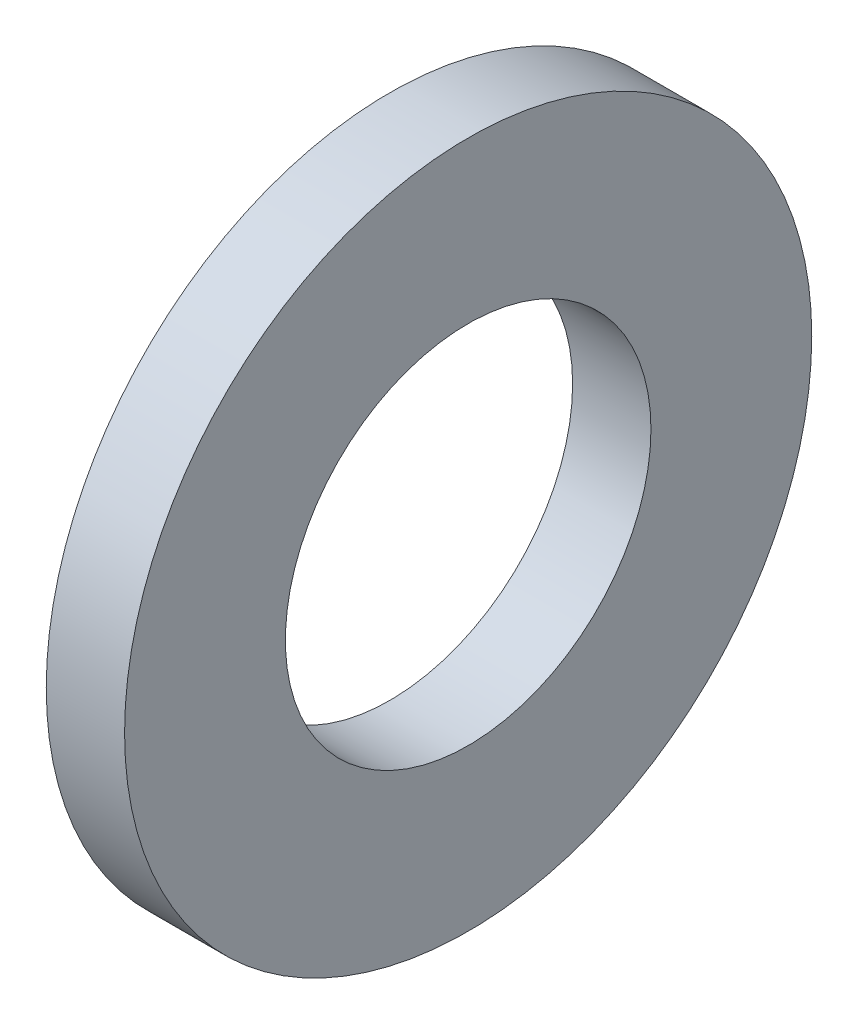
ISO-10303-21;
HEADER;
FILE_DESCRIPTION(('STEP AP214'),'2;1');
FILE_NAME('part.step','',(''),(''),'','','');
FILE_SCHEMA(('AUTOMOTIVE_DESIGN { 1 0 10303 214 1 1 1 1 }'));
ENDSEC;
DATA;
#1=APPLICATION_CONTEXT('core data for automotive mechanical design processes');
#2=APPLICATION_PROTOCOL_DEFINITION('international standard','automotive_design',2000,#1);
#3=PRODUCT_CONTEXT('',#1,'mechanical');
#4=PRODUCT('Part','Part','',(#3));
#5=PRODUCT_RELATED_PRODUCT_CATEGORY('part','',(#4));
#6=PRODUCT_DEFINITION_FORMATION('','',#4);
#7=PRODUCT_DEFINITION_CONTEXT('part definition',#1,'design');
#8=PRODUCT_DEFINITION('design','',#6,#7);
#9=PRODUCT_DEFINITION_SHAPE('','',#8);
#10=(LENGTH_UNIT() NAMED_UNIT(*) SI_UNIT(.MILLI.,.METRE.));
#11=(NAMED_UNIT(*) PLANE_ANGLE_UNIT() SI_UNIT($,.RADIAN.));
#12=(NAMED_UNIT(*) SI_UNIT($,.STERADIAN.) SOLID_ANGLE_UNIT());
#13=UNCERTAINTY_MEASURE_WITH_UNIT(LENGTH_MEASURE(1.E-05),#10,'distance_accuracy_value','');
#14=(GEOMETRIC_REPRESENTATION_CONTEXT(3) GLOBAL_UNCERTAINTY_ASSIGNED_CONTEXT((#13)) GLOBAL_UNIT_ASSIGNED_CONTEXT((#10,
#11,#12)) REPRESENTATION_CONTEXT('',''));
#15=CARTESIAN_POINT('',(0.,0.,0.));
#16=DIRECTION('',(0.,0.,1.));
#17=DIRECTION('',(1.,0.,0.));
#18=AXIS2_PLACEMENT_3D('',#15,#16,#17);
#19=CARTESIAN_POINT('',(1.4478,0.,0.));
#20=DIRECTION('',(1.,0.,0.));
#21=DIRECTION('',(0.,0.,-1.));
#22=AXIS2_PLACEMENT_3D('',#19,#20,#21);
#23=PLANE('',#22);
#24=CARTESIAN_POINT('',(1.4478,0.,0.));
#25=DIRECTION('',(1.,0.,0.));
#26=DIRECTION('',(0.,0.,-1.));
#27=AXIS2_PLACEMENT_3D('',#24,#25,#26);
#28=CIRCLE('',#27,6.35);
#29=CARTESIAN_POINT('',(1.4478,0.,-6.35));
#30=VERTEX_POINT('',#29);
#31=EDGE_CURVE('E10',#30,#30,#28,.T.);
#32=ORIENTED_EDGE('',*,*,#31,.T.);
#33=EDGE_LOOP('',(#32));
#34=FACE_BOUND('',#33,.T.);
#35=CARTESIAN_POINT('',(1.4478,0.,0.));
#36=DIRECTION('',(1.,0.,0.));
#37=DIRECTION('',(0.,0.,-1.));
#38=AXIS2_PLACEMENT_3D('',#35,#36,#37);
#39=CIRCLE('',#38,3.3782);
#40=CARTESIAN_POINT('',(1.4478,0.,-3.3782));
#41=VERTEX_POINT('',#40);
#42=EDGE_CURVE('E41',#41,#41,#39,.T.);
#43=ORIENTED_EDGE('',*,*,#42,.F.);
#44=EDGE_LOOP('',(#43));
#45=FACE_BOUND('',#44,.T.);
#46=ADVANCED_FACE('F30',(#34,#45),#23,.T.);
#47=CARTESIAN_POINT('',(0.,0.,0.));
#48=DIRECTION('',(1.,0.,0.));
#49=DIRECTION('',(0.,0.,-1.));
#50=AXIS2_PLACEMENT_3D('',#47,#48,#49);
#51=PLANE('',#50);
#52=CARTESIAN_POINT('',(0.,0.,0.));
#53=DIRECTION('',(1.,0.,0.));
#54=DIRECTION('',(0.,0.,-1.));
#55=AXIS2_PLACEMENT_3D('',#52,#53,#54);
#56=CIRCLE('',#55,6.35);
#57=CARTESIAN_POINT('',(0.,0.,-6.35));
#58=VERTEX_POINT('',#57);
#59=EDGE_CURVE('E34',#58,#58,#56,.T.);
#60=ORIENTED_EDGE('',*,*,#59,.F.);
#61=EDGE_LOOP('',(#60));
#62=FACE_BOUND('',#61,.T.);
#63=CARTESIAN_POINT('',(0.,0.,0.));
#64=DIRECTION('',(1.,0.,0.));
#65=DIRECTION('',(0.,0.,-1.));
#66=AXIS2_PLACEMENT_3D('',#63,#64,#65);
#67=CIRCLE('',#66,3.3782);
#68=CARTESIAN_POINT('',(0.,0.,-3.3782));
#69=VERTEX_POINT('',#68);
#70=EDGE_CURVE('E43',#69,#69,#67,.T.);
#71=ORIENTED_EDGE('',*,*,#70,.T.);
#72=EDGE_LOOP('',(#71));
#73=FACE_BOUND('',#72,.T.);
#74=ADVANCED_FACE('F53',(#62,#73),#51,.F.);
#75=CARTESIAN_POINT('',(1.4478,0.,0.));
#76=DIRECTION('',(-1.,0.,0.));
#77=DIRECTION('',(0.,0.,1.));
#78=AXIS2_PLACEMENT_3D('',#75,#76,#77);
#79=CYLINDRICAL_SURFACE('',#78,6.35);
#80=ORIENTED_EDGE('',*,*,#31,.F.);
#81=EDGE_LOOP('',(#80));
#82=FACE_BOUND('',#81,.T.);
#83=ORIENTED_EDGE('',*,*,#59,.T.);
#84=EDGE_LOOP('',(#83));
#85=FACE_BOUND('',#84,.T.);
#86=ADVANCED_FACE('F32',(#82,#85),#79,.T.);
#87=CARTESIAN_POINT('',(1.4478,0.,0.));
#88=DIRECTION('',(-1.,0.,0.));
#89=DIRECTION('',(0.,0.,1.));
#90=AXIS2_PLACEMENT_3D('',#87,#88,#89);
#91=CYLINDRICAL_SURFACE('',#90,3.3782);
#92=ORIENTED_EDGE('',*,*,#42,.T.);
#93=EDGE_LOOP('',(#92));
#94=FACE_BOUND('',#93,.T.);
#95=ORIENTED_EDGE('',*,*,#70,.F.);
#96=EDGE_LOOP('',(#95));
#97=FACE_BOUND('',#96,.T.);
#98=ADVANCED_FACE('F49',(#94,#97),#91,.F.);
#99=CLOSED_SHELL('',(#46,#74,#86,#98));
#100=MANIFOLD_SOLID_BREP('B2',#99);
#101=ADVANCED_BREP_SHAPE_REPRESENTATION('',(#18,#100),#14);
#102=SHAPE_DEFINITION_REPRESENTATION(#9,#101);
ENDSEC;
END-ISO-10303-21;
